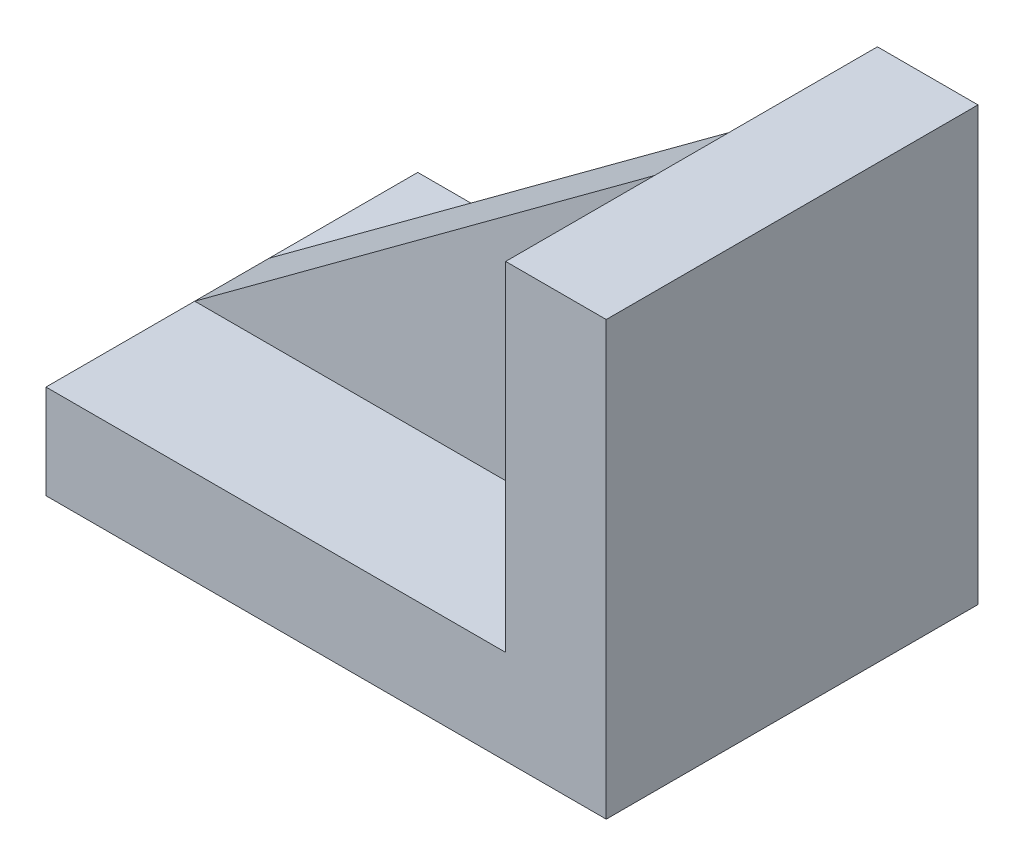
ISO-10303-21;
HEADER;
FILE_DESCRIPTION(('STEP AP214'),'2;1');
FILE_NAME('part.step','',(''),(''),'','','');
FILE_SCHEMA(('AUTOMOTIVE_DESIGN { 1 0 10303 214 1 1 1 1 }'));
ENDSEC;
DATA;
#1=APPLICATION_CONTEXT('core data for automotive mechanical design processes');
#2=APPLICATION_PROTOCOL_DEFINITION('international standard','automotive_design',2000,#1);
#3=PRODUCT_CONTEXT('',#1,'mechanical');
#4=PRODUCT('Part','Part','',(#3));
#5=PRODUCT_RELATED_PRODUCT_CATEGORY('part','',(#4));
#6=PRODUCT_DEFINITION_FORMATION('','',#4);
#7=PRODUCT_DEFINITION_CONTEXT('part definition',#1,'design');
#8=PRODUCT_DEFINITION('design','',#6,#7);
#9=PRODUCT_DEFINITION_SHAPE('','',#8);
#10=(LENGTH_UNIT() NAMED_UNIT(*) SI_UNIT(.MILLI.,.METRE.));
#11=(NAMED_UNIT(*) PLANE_ANGLE_UNIT() SI_UNIT($,.RADIAN.));
#12=(NAMED_UNIT(*) SI_UNIT($,.STERADIAN.) SOLID_ANGLE_UNIT());
#13=UNCERTAINTY_MEASURE_WITH_UNIT(LENGTH_MEASURE(1.E-05),#10,'distance_accuracy_value','');
#14=(GEOMETRIC_REPRESENTATION_CONTEXT(3) GLOBAL_UNCERTAINTY_ASSIGNED_CONTEXT((#13)) GLOBAL_UNIT_ASSIGNED_CONTEXT((#10,
#11,#12)) REPRESENTATION_CONTEXT('',''));
#15=CARTESIAN_POINT('',(0.,0.,0.));
#16=DIRECTION('',(0.,0.,1.));
#17=DIRECTION('',(1.,0.,0.));
#18=AXIS2_PLACEMENT_3D('',#15,#16,#17);
#19=CARTESIAN_POINT('',(0.,0.,25.));
#20=DIRECTION('',(0.,-1.,0.));
#21=DIRECTION('',(0.,0.,-1.));
#22=AXIS2_PLACEMENT_3D('',#19,#20,#21);
#23=PLANE('',#22);
#24=DIRECTION('',(-1.,0.,0.));
#25=VECTOR('',#24,1.);
#26=CARTESIAN_POINT('',(0.,0.,-5.));
#27=LINE('',#26,#25);
#28=CARTESIAN_POINT('',(0.,0.,-5.));
#29=VERTEX_POINT('',#28);
#30=CARTESIAN_POINT('',(-61.8202245082201,0.,-5.));
#31=VERTEX_POINT('',#30);
#32=EDGE_CURVE('E183',#29,#31,#27,.T.);
#33=ORIENTED_EDGE('',*,*,#32,.F.);
#34=DIRECTION('',(0.,0.,-1.));
#35=VECTOR('',#34,1.);
#36=CARTESIAN_POINT('',(0.,0.,25.));
#37=LINE('',#36,#35);
#38=CARTESIAN_POINT('',(0.,0.,-25.));
#39=VERTEX_POINT('',#38);
#40=EDGE_CURVE('E86',#29,#39,#37,.T.);
#41=ORIENTED_EDGE('',*,*,#40,.T.);
#42=DIRECTION('',(-1.,0.,0.));
#43=VECTOR('',#42,1.);
#44=CARTESIAN_POINT('',(0.,0.,-25.));
#45=LINE('',#44,#43);
#46=CARTESIAN_POINT('',(-61.8202245082201,0.,-25.));
#47=VERTEX_POINT('',#46);
#48=EDGE_CURVE('E137',#39,#47,#45,.T.);
#49=ORIENTED_EDGE('',*,*,#48,.T.);
#50=DIRECTION('',(0.,0.,-1.));
#51=VECTOR('',#50,1.);
#52=CARTESIAN_POINT('',(-61.8202245082201,0.,25.));
#53=LINE('',#52,#51);
#54=EDGE_CURVE('E160',#31,#47,#53,.T.);
#55=ORIENTED_EDGE('',*,*,#54,.F.);
#56=EDGE_LOOP('',(#33,#41,#49,#55));
#57=FACE_BOUND('',#56,.T.);
#58=ADVANCED_FACE('F33',(#57),#23,.F.);
#59=CARTESIAN_POINT('',(0.,0.,25.));
#60=DIRECTION('',(-1.,0.,0.));
#61=DIRECTION('',(0.,0.,1.));
#62=AXIS2_PLACEMENT_3D('',#59,#60,#61);
#63=PLANE('',#62);
#64=ORIENTED_EDGE('',*,*,#40,.F.);
#65=DIRECTION('',(0.,1.,0.));
#66=VECTOR('',#65,1.);
#67=CARTESIAN_POINT('',(0.,0.,-5.));
#68=LINE('',#67,#66);
#69=CARTESIAN_POINT('',(0.,45.5393256873529,-5.));
#70=VERTEX_POINT('',#69);
#71=EDGE_CURVE('E41',#29,#70,#68,.T.);
#72=ORIENTED_EDGE('',*,*,#71,.T.);
#73=DIRECTION('',(0.,0.,-1.));
#74=VECTOR('',#73,1.);
#75=CARTESIAN_POINT('',(0.,45.5393256873529,25.));
#76=LINE('',#75,#74);
#77=CARTESIAN_POINT('',(0.,45.5393256873529,-25.));
#78=VERTEX_POINT('',#77);
#79=EDGE_CURVE('E154',#70,#78,#76,.T.);
#80=ORIENTED_EDGE('',*,*,#79,.T.);
#81=DIRECTION('',(0.,1.,0.));
#82=VECTOR('',#81,1.);
#83=CARTESIAN_POINT('',(0.,0.,-25.));
#84=LINE('',#83,#82);
#85=EDGE_CURVE('E149',#39,#78,#84,.T.);
#86=ORIENTED_EDGE('',*,*,#85,.F.);
#87=EDGE_LOOP('',(#64,#72,#80,#86));
#88=FACE_BOUND('',#87,.T.);
#89=ADVANCED_FACE('F165',(#88),#63,.T.);
#90=CARTESIAN_POINT('',(0.,0.,25.));
#91=VERTEX_POINT('',#90);
#92=CARTESIAN_POINT('',(0.,0.,5.));
#93=VERTEX_POINT('',#92);
#94=EDGE_CURVE('E57',#91,#93,#37,.T.);
#95=ORIENTED_EDGE('',*,*,#94,.T.);
#96=DIRECTION('',(-1.,0.,0.));
#97=VECTOR('',#96,1.);
#98=CARTESIAN_POINT('',(0.,0.,5.));
#99=LINE('',#98,#97);
#100=CARTESIAN_POINT('',(-61.8202245082201,0.,5.));
#101=VERTEX_POINT('',#100);
#102=EDGE_CURVE('E185',#93,#101,#99,.T.);
#103=ORIENTED_EDGE('',*,*,#102,.T.);
#104=CARTESIAN_POINT('',(-61.8202245082201,0.,25.));
#105=VERTEX_POINT('',#104);
#106=EDGE_CURVE('E161',#105,#101,#53,.T.);
#107=ORIENTED_EDGE('',*,*,#106,.F.);
#108=DIRECTION('',(-1.,0.,0.));
#109=VECTOR('',#108,1.);
#110=CARTESIAN_POINT('',(0.,0.,25.));
#111=LINE('',#110,#109);
#112=EDGE_CURVE('E152',#91,#105,#111,.T.);
#113=ORIENTED_EDGE('',*,*,#112,.F.);
#114=EDGE_LOOP('',(#95,#103,#107,#113));
#115=FACE_BOUND('',#114,.T.);
#116=ADVANCED_FACE('F35',(#115),#23,.F.);
#117=CARTESIAN_POINT('',(-61.8202245082201,0.,25.));
#118=DIRECTION('',(1.,0.,0.));
#119=DIRECTION('',(0.,0.,-1.));
#120=AXIS2_PLACEMENT_3D('',#117,#118,#119);
#121=PLANE('',#120);
#122=ORIENTED_EDGE('',*,*,#106,.T.);
#123=DIRECTION('',(0.,0.,1.));
#124=VECTOR('',#123,1.);
#125=CARTESIAN_POINT('',(-61.8202245082201,0.,25.));
#126=LINE('',#125,#124);
#127=EDGE_CURVE('E140',#31,#101,#126,.T.);
#128=ORIENTED_EDGE('',*,*,#127,.F.);
#129=ORIENTED_EDGE('',*,*,#54,.T.);
#130=DIRECTION('',(0.,-1.,0.));
#131=VECTOR('',#130,1.);
#132=CARTESIAN_POINT('',(-61.8202245082201,0.,-25.));
#133=LINE('',#132,#131);
#134=CARTESIAN_POINT('',(-61.8202245082201,-12.6629213051189,-25.));
#135=VERTEX_POINT('',#134);
#136=EDGE_CURVE('E139',#47,#135,#133,.T.);
#137=ORIENTED_EDGE('',*,*,#136,.T.);
#138=DIRECTION('',(0.,0.,-1.));
#139=VECTOR('',#138,1.);
#140=CARTESIAN_POINT('',(-61.8202245082201,-12.6629213051189,25.));
#141=LINE('',#140,#139);
#142=CARTESIAN_POINT('',(-61.8202245082201,-12.6629213051189,25.));
#143=VERTEX_POINT('',#142);
#144=EDGE_CURVE('E158',#143,#135,#141,.T.);
#145=ORIENTED_EDGE('',*,*,#144,.F.);
#146=DIRECTION('',(0.,-1.,0.));
#147=VECTOR('',#146,1.);
#148=CARTESIAN_POINT('',(-61.8202245082201,0.,25.));
#149=LINE('',#148,#147);
#150=EDGE_CURVE('E95',#105,#143,#149,.T.);
#151=ORIENTED_EDGE('',*,*,#150,.F.);
#152=EDGE_LOOP('',(#122,#128,#129,#137,#145,#151));
#153=FACE_BOUND('',#152,.T.);
#154=ADVANCED_FACE('F199',(#153),#121,.F.);
#155=CARTESIAN_POINT('',(0.,-12.6629213051189,25.));
#156=DIRECTION('',(0.,1.,0.));
#157=DIRECTION('',(0.,0.,1.));
#158=AXIS2_PLACEMENT_3D('',#155,#156,#157);
#159=PLANE('',#158);
#160=ORIENTED_EDGE('',*,*,#144,.T.);
#161=DIRECTION('',(1.,0.,0.));
#162=VECTOR('',#161,1.);
#163=CARTESIAN_POINT('',(0.,-12.6629213051189,-25.));
#164=LINE('',#163,#162);
#165=CARTESIAN_POINT('',(13.5280898414935,-12.6629213051189,-25.));
#166=VERTEX_POINT('',#165);
#167=EDGE_CURVE('E143',#135,#166,#164,.T.);
#168=ORIENTED_EDGE('',*,*,#167,.T.);
#169=DIRECTION('',(0.,0.,-1.));
#170=VECTOR('',#169,1.);
#171=CARTESIAN_POINT('',(13.5280898414935,-12.6629213051189,25.));
#172=LINE('',#171,#170);
#173=CARTESIAN_POINT('',(13.5280898414935,-12.6629213051189,25.));
#174=VERTEX_POINT('',#173);
#175=EDGE_CURVE('E126',#174,#166,#172,.T.);
#176=ORIENTED_EDGE('',*,*,#175,.F.);
#177=DIRECTION('',(-1.,0.,0.));
#178=VECTOR('',#177,1.);
#179=CARTESIAN_POINT('',(0.,-12.6629213051189,25.));
#180=LINE('',#179,#178);
#181=EDGE_CURVE('E114',#174,#143,#180,.T.);
#182=ORIENTED_EDGE('',*,*,#181,.T.);
#183=EDGE_LOOP('',(#160,#168,#176,#182));
#184=FACE_BOUND('',#183,.T.);
#185=ADVANCED_FACE('F193',(#184),#159,.F.);
#186=CARTESIAN_POINT('',(13.5280898414935,-12.6629213051189,25.));
#187=DIRECTION('',(-1.,0.,0.));
#188=DIRECTION('',(0.,0.,1.));
#189=AXIS2_PLACEMENT_3D('',#186,#187,#188);
#190=PLANE('',#189);
#191=ORIENTED_EDGE('',*,*,#175,.T.);
#192=DIRECTION('',(0.,1.,0.));
#193=VECTOR('',#192,1.);
#194=CARTESIAN_POINT('',(13.5280898414935,-12.6629213051189,-25.));
#195=LINE('',#194,#193);
#196=CARTESIAN_POINT('',(13.5280898414935,45.5393256873529,-25.));
#197=VERTEX_POINT('',#196);
#198=EDGE_CURVE('E122',#166,#197,#195,.T.);
#199=ORIENTED_EDGE('',*,*,#198,.T.);
#200=DIRECTION('',(0.,0.,-1.));
#201=VECTOR('',#200,1.);
#202=CARTESIAN_POINT('',(13.5280898414935,45.5393256873529,25.));
#203=LINE('',#202,#201);
#204=CARTESIAN_POINT('',(13.5280898414935,45.5393256873529,25.));
#205=VERTEX_POINT('',#204);
#206=EDGE_CURVE('E119',#205,#197,#203,.T.);
#207=ORIENTED_EDGE('',*,*,#206,.F.);
#208=DIRECTION('',(0.,1.,0.));
#209=VECTOR('',#208,1.);
#210=CARTESIAN_POINT('',(13.5280898414935,-12.6629213051189,25.));
#211=LINE('',#210,#209);
#212=EDGE_CURVE('E107',#174,#205,#211,.T.);
#213=ORIENTED_EDGE('',*,*,#212,.F.);
#214=EDGE_LOOP('',(#191,#199,#207,#213));
#215=FACE_BOUND('',#214,.T.);
#216=ADVANCED_FACE('F120',(#215),#190,.F.);
#217=CARTESIAN_POINT('',(0.,45.5393256873529,25.));
#218=DIRECTION('',(0.,1.,0.));
#219=DIRECTION('',(0.,0.,1.));
#220=AXIS2_PLACEMENT_3D('',#217,#218,#219);
#221=PLANE('',#220);
#222=ORIENTED_EDGE('',*,*,#206,.T.);
#223=DIRECTION('',(1.,0.,0.));
#224=VECTOR('',#223,1.);
#225=CARTESIAN_POINT('',(0.,45.5393256873529,-25.));
#226=LINE('',#225,#224);
#227=EDGE_CURVE('E147',#78,#197,#226,.T.);
#228=ORIENTED_EDGE('',*,*,#227,.F.);
#229=ORIENTED_EDGE('',*,*,#79,.F.);
#230=CARTESIAN_POINT('',(0.,45.5393256873529,5.));
#231=VERTEX_POINT('',#230);
#232=EDGE_CURVE('E155',#231,#70,#76,.T.);
#233=ORIENTED_EDGE('',*,*,#232,.F.);
#234=CARTESIAN_POINT('',(0.,45.5393256873529,25.));
#235=VERTEX_POINT('',#234);
#236=EDGE_CURVE('E127',#235,#231,#76,.T.);
#237=ORIENTED_EDGE('',*,*,#236,.F.);
#238=DIRECTION('',(1.,0.,0.));
#239=VECTOR('',#238,1.);
#240=CARTESIAN_POINT('',(0.,45.5393256873529,25.));
#241=LINE('',#240,#239);
#242=EDGE_CURVE('E112',#235,#205,#241,.T.);
#243=ORIENTED_EDGE('',*,*,#242,.T.);
#244=EDGE_LOOP('',(#222,#228,#229,#233,#237,#243));
#245=FACE_BOUND('',#244,.T.);
#246=ADVANCED_FACE('F129',(#245),#221,.T.);
#247=DIRECTION('',(0.,1.,0.));
#248=VECTOR('',#247,1.);
#249=CARTESIAN_POINT('',(0.,0.,5.));
#250=LINE('',#249,#248);
#251=EDGE_CURVE('E11',#93,#231,#250,.T.);
#252=ORIENTED_EDGE('',*,*,#251,.F.);
#253=ORIENTED_EDGE('',*,*,#94,.F.);
#254=DIRECTION('',(0.,1.,0.));
#255=VECTOR('',#254,1.);
#256=CARTESIAN_POINT('',(0.,0.,25.));
#257=LINE('',#256,#255);
#258=EDGE_CURVE('E132',#91,#235,#257,.T.);
#259=ORIENTED_EDGE('',*,*,#258,.T.);
#260=ORIENTED_EDGE('',*,*,#236,.T.);
#261=EDGE_LOOP('',(#252,#253,#259,#260));
#262=FACE_BOUND('',#261,.T.);
#263=ADVANCED_FACE('F203',(#262),#63,.T.);
#264=CARTESIAN_POINT('',(0.,0.,25.));
#265=DIRECTION('',(0.,0.,1.));
#266=DIRECTION('',(1.,0.,0.));
#267=AXIS2_PLACEMENT_3D('',#264,#265,#266);
#268=PLANE('',#267);
#269=ORIENTED_EDGE('',*,*,#112,.T.);
#270=ORIENTED_EDGE('',*,*,#150,.T.);
#271=ORIENTED_EDGE('',*,*,#181,.F.);
#272=ORIENTED_EDGE('',*,*,#212,.T.);
#273=ORIENTED_EDGE('',*,*,#242,.F.);
#274=ORIENTED_EDGE('',*,*,#258,.F.);
#275=EDGE_LOOP('',(#269,#270,#271,#272,#273,#274));
#276=FACE_BOUND('',#275,.T.);
#277=ADVANCED_FACE('F109',(#276),#268,.T.);
#278=CARTESIAN_POINT('',(0.,0.,-25.));
#279=DIRECTION('',(0.,0.,1.));
#280=DIRECTION('',(1.,0.,0.));
#281=AXIS2_PLACEMENT_3D('',#278,#279,#280);
#282=PLANE('',#281);
#283=ORIENTED_EDGE('',*,*,#48,.F.);
#284=ORIENTED_EDGE('',*,*,#85,.T.);
#285=ORIENTED_EDGE('',*,*,#227,.T.);
#286=ORIENTED_EDGE('',*,*,#198,.F.);
#287=ORIENTED_EDGE('',*,*,#167,.F.);
#288=ORIENTED_EDGE('',*,*,#136,.F.);
#289=EDGE_LOOP('',(#283,#284,#285,#286,#287,#288));
#290=FACE_BOUND('',#289,.T.);
#291=ADVANCED_FACE('F197',(#290),#282,.F.);
#292=CARTESIAN_POINT('',(-24.1460673333633,16.438202191117,5.));
#293=DIRECTION('',(0.,0.,1.));
#294=DIRECTION('',(1.,0.,0.));
#295=AXIS2_PLACEMENT_3D('',#292,#293,#294);
#296=PLANE('',#295);
#297=ORIENTED_EDGE('',*,*,#102,.F.);
#298=ORIENTED_EDGE('',*,*,#251,.T.);
#299=DIRECTION('',(-0.80513306998625,-0.593094208043306,0.));
#300=VECTOR('',#299,1.);
#301=CARTESIAN_POINT('',(0.,45.5393256873529,5.));
#302=LINE('',#301,#300);
#303=EDGE_CURVE('E176',#231,#101,#302,.T.);
#304=ORIENTED_EDGE('',*,*,#303,.T.);
#305=EDGE_LOOP('',(#297,#298,#304));
#306=FACE_BOUND('',#305,.T.);
#307=ADVANCED_FACE('F202',(#306),#296,.T.);
#308=CARTESIAN_POINT('',(-24.1460673333633,16.438202191117,-5.));
#309=DIRECTION('',(0.,0.,1.));
#310=DIRECTION('',(1.,0.,0.));
#311=AXIS2_PLACEMENT_3D('',#308,#309,#310);
#312=PLANE('',#311);
#313=ORIENTED_EDGE('',*,*,#71,.F.);
#314=ORIENTED_EDGE('',*,*,#32,.T.);
#315=DIRECTION('',(-0.80513306998625,-0.593094208043306,0.));
#316=VECTOR('',#315,1.);
#317=CARTESIAN_POINT('',(0.,45.5393256873529,-5.));
#318=LINE('',#317,#316);
#319=EDGE_CURVE('E48',#70,#31,#318,.T.);
#320=ORIENTED_EDGE('',*,*,#319,.F.);
#321=EDGE_LOOP('',(#313,#314,#320));
#322=FACE_BOUND('',#321,.T.);
#323=ADVANCED_FACE('F249',(#322),#312,.F.);
#324=CARTESIAN_POINT('',(0.,45.5393256873529,0.));
#325=DIRECTION('',(-0.593094208043306,0.80513306998625,0.));
#326=DIRECTION('',(-0.80513306998625,-0.593094208043306,0.));
#327=AXIS2_PLACEMENT_3D('',#324,#325,#326);
#328=PLANE('',#327);
#329=ORIENTED_EDGE('',*,*,#319,.T.);
#330=ORIENTED_EDGE('',*,*,#127,.T.);
#331=ORIENTED_EDGE('',*,*,#303,.F.);
#332=ORIENTED_EDGE('',*,*,#232,.T.);
#333=EDGE_LOOP('',(#329,#330,#331,#332));
#334=FACE_BOUND('',#333,.T.);
#335=ADVANCED_FACE('F171',(#334),#328,.T.);
#336=CLOSED_SHELL('',(#58,#89,#116,#154,#185,#216,#246,#263,#277,#291,#307,#323,#335));
#337=MANIFOLD_SOLID_BREP('B2',#336);
#338=ADVANCED_BREP_SHAPE_REPRESENTATION('',(#18,#337),#14);
#339=SHAPE_DEFINITION_REPRESENTATION(#9,#338);
ENDSEC;
END-ISO-10303-21;
